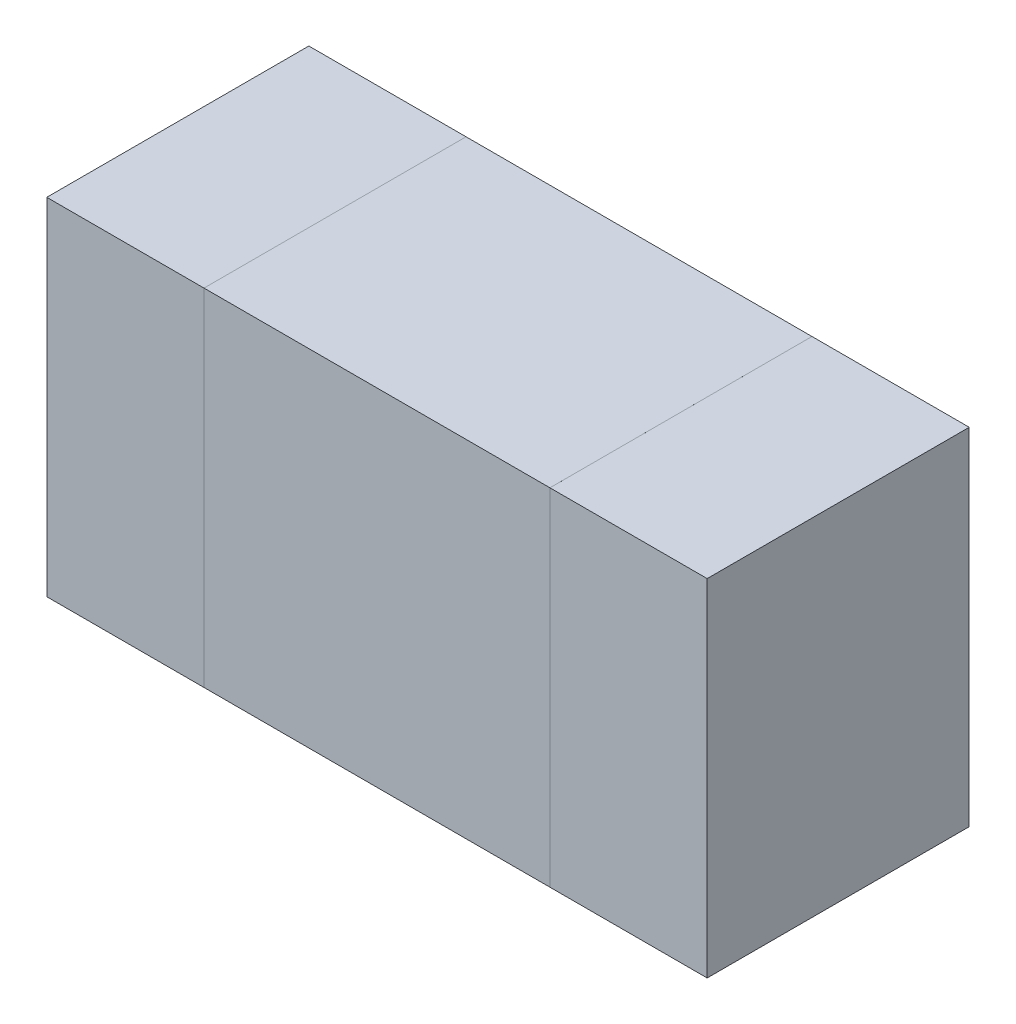
ISO-10303-21;
HEADER;
FILE_DESCRIPTION(('STEP AP214'),'2;1');
FILE_NAME('part.step','',(''),(''),'','','');
FILE_SCHEMA(('AUTOMOTIVE_DESIGN { 1 0 10303 214 1 1 1 1 }'));
ENDSEC;
DATA;
#1=APPLICATION_CONTEXT('core data for automotive mechanical design processes');
#2=APPLICATION_PROTOCOL_DEFINITION('international standard','automotive_design',2000,#1);
#3=PRODUCT_CONTEXT('',#1,'mechanical');
#4=PRODUCT('Part','Part','',(#3));
#5=PRODUCT_RELATED_PRODUCT_CATEGORY('part','',(#4));
#6=PRODUCT_DEFINITION_FORMATION('','',#4);
#7=PRODUCT_DEFINITION_CONTEXT('part definition',#1,'design');
#8=PRODUCT_DEFINITION('design','',#6,#7);
#9=PRODUCT_DEFINITION_SHAPE('','',#8);
#10=(LENGTH_UNIT() NAMED_UNIT(*) SI_UNIT(.MILLI.,.METRE.));
#11=(NAMED_UNIT(*) PLANE_ANGLE_UNIT() SI_UNIT($,.RADIAN.));
#12=(NAMED_UNIT(*) SI_UNIT($,.STERADIAN.) SOLID_ANGLE_UNIT());
#13=UNCERTAINTY_MEASURE_WITH_UNIT(LENGTH_MEASURE(1.E-05),#10,'distance_accuracy_value','');
#14=(GEOMETRIC_REPRESENTATION_CONTEXT(3) GLOBAL_UNCERTAINTY_ASSIGNED_CONTEXT((#13)) GLOBAL_UNIT_ASSIGNED_CONTEXT((#10,
#11,#12)) REPRESENTATION_CONTEXT('',''));
#15=CARTESIAN_POINT('',(0.,0.,0.));
#16=DIRECTION('',(0.,0.,1.));
#17=DIRECTION('',(1.,0.,0.));
#18=AXIS2_PLACEMENT_3D('',#15,#16,#17);
#19=CARTESIAN_POINT('',(9.38999031418,8.734999960195,0.2499995));
#20=DIRECTION('',(0.,0.,-1.));
#21=DIRECTION('',(0.,-1.,0.));
#22=AXIS2_PLACEMENT_3D('',#19,#20,#21);
#23=PLANE('',#22);
#24=DIRECTION('',(0.,1.,0.));
#25=VECTOR('',#24,1.);
#26=CARTESIAN_POINT('',(9.38999031418,8.734999960195,0.2499995));
#27=LINE('',#26,#25);
#28=CARTESIAN_POINT('',(9.38999031418,8.734999960195,0.2499995));
#29=VERTEX_POINT('',#28);
#30=CARTESIAN_POINT('',(9.38999031418,9.064996760195,0.2499995));
#31=VERTEX_POINT('',#30);
#32=EDGE_CURVE('P0_E93',#29,#31,#27,.T.);
#33=ORIENTED_EDGE('',*,*,#32,.T.);
#34=DIRECTION('',(-1.,0.,0.));
#35=VECTOR('',#34,1.);
#36=CARTESIAN_POINT('',(9.38999031418,9.064996760195,0.2499995));
#37=LINE('',#36,#35);
#38=CARTESIAN_POINT('',(9.05999605418,9.064996760195,0.2499995));
#39=VERTEX_POINT('',#38);
#40=EDGE_CURVE('P0_E72',#31,#39,#37,.T.);
#41=ORIENTED_EDGE('',*,*,#40,.T.);
#42=DIRECTION('',(0.,-1.,0.));
#43=VECTOR('',#42,1.);
#44=CARTESIAN_POINT('',(9.05999605418,9.064996760195,0.2499995));
#45=LINE('',#44,#43);
#46=CARTESIAN_POINT('',(9.05999605418,8.734999960195,0.2499995));
#47=VERTEX_POINT('',#46);
#48=EDGE_CURVE('P0_E77',#39,#47,#45,.T.);
#49=ORIENTED_EDGE('',*,*,#48,.T.);
#50=DIRECTION('',(1.,0.,0.));
#51=VECTOR('',#50,1.);
#52=CARTESIAN_POINT('',(9.05999605418,8.734999960195,0.2499995));
#53=LINE('',#52,#51);
#54=EDGE_CURVE('P0_E11',#47,#29,#53,.T.);
#55=ORIENTED_EDGE('',*,*,#54,.T.);
#56=EDGE_LOOP('',(#33,#41,#49,#55));
#57=FACE_BOUND('',#56,.T.);
#58=ADVANCED_FACE('P0_F17',(#57),#23,.F.);
#59=CARTESIAN_POINT('',(9.38999031418,8.734999960195,0.));
#60=DIRECTION('',(0.,0.,-1.));
#61=DIRECTION('',(0.,-1.,0.));
#62=AXIS2_PLACEMENT_3D('',#59,#60,#61);
#63=PLANE('',#62);
#64=DIRECTION('',(1.,0.,0.));
#65=VECTOR('',#64,1.);
#66=CARTESIAN_POINT('',(9.05999605418,8.734999960195,0.));
#67=LINE('',#66,#65);
#68=CARTESIAN_POINT('',(9.05999605418,8.734999960195,0.));
#69=VERTEX_POINT('',#68);
#70=CARTESIAN_POINT('',(9.38999031418,8.734999960195,0.));
#71=VERTEX_POINT('',#70);
#72=EDGE_CURVE('P0_E20',#69,#71,#67,.T.);
#73=ORIENTED_EDGE('',*,*,#72,.F.);
#74=DIRECTION('',(0.,-1.,0.));
#75=VECTOR('',#74,1.);
#76=CARTESIAN_POINT('',(9.05999605418,9.064996760195,0.));
#77=LINE('',#76,#75);
#78=CARTESIAN_POINT('',(9.05999605418,9.064996760195,0.));
#79=VERTEX_POINT('',#78);
#80=EDGE_CURVE('P0_E61',#79,#69,#77,.T.);
#81=ORIENTED_EDGE('',*,*,#80,.F.);
#82=DIRECTION('',(-1.,0.,0.));
#83=VECTOR('',#82,1.);
#84=CARTESIAN_POINT('',(9.38999031418,9.064996760195,0.));
#85=LINE('',#84,#83);
#86=CARTESIAN_POINT('',(9.38999031418,9.064996760195,0.));
#87=VERTEX_POINT('',#86);
#88=EDGE_CURVE('P0_E66',#87,#79,#85,.T.);
#89=ORIENTED_EDGE('',*,*,#88,.F.);
#90=DIRECTION('',(0.,1.,0.));
#91=VECTOR('',#90,1.);
#92=CARTESIAN_POINT('',(9.38999031418,8.734999960195,0.));
#93=LINE('',#92,#91);
#94=EDGE_CURVE('P0_E115',#71,#87,#93,.T.);
#95=ORIENTED_EDGE('',*,*,#94,.F.);
#96=EDGE_LOOP('',(#73,#81,#89,#95));
#97=FACE_BOUND('',#96,.T.);
#98=ADVANCED_FACE('P0_F63',(#97),#63,.T.);
#99=CARTESIAN_POINT('',(9.05999605418,8.734999960195,0.));
#100=DIRECTION('',(0.,1.,0.));
#101=DIRECTION('',(1.,0.,0.));
#102=AXIS2_PLACEMENT_3D('',#99,#100,#101);
#103=PLANE('',#102);
#104=ORIENTED_EDGE('',*,*,#72,.T.);
#105=DIRECTION('',(0.,0.,1.));
#106=VECTOR('',#105,1.);
#107=CARTESIAN_POINT('',(9.38999031418,8.734999960195,0.));
#108=LINE('',#107,#106);
#109=EDGE_CURVE('P0_E88',#71,#29,#108,.T.);
#110=ORIENTED_EDGE('',*,*,#109,.T.);
#111=ORIENTED_EDGE('',*,*,#54,.F.);
#112=DIRECTION('',(0.,0.,1.));
#113=VECTOR('',#112,1.);
#114=CARTESIAN_POINT('',(9.05999605418,8.734999960195,0.));
#115=LINE('',#114,#113);
#116=EDGE_CURVE('P0_E71',#69,#47,#115,.T.);
#117=ORIENTED_EDGE('',*,*,#116,.F.);
#118=EDGE_LOOP('',(#104,#110,#111,#117));
#119=FACE_BOUND('',#118,.T.);
#120=ADVANCED_FACE('P0_F109',(#119),#103,.F.);
#121=CARTESIAN_POINT('',(9.05999605418,9.064996760195,0.));
#122=DIRECTION('',(1.,0.,0.));
#123=DIRECTION('',(0.,1.,0.));
#124=AXIS2_PLACEMENT_3D('',#121,#122,#123);
#125=PLANE('',#124);
#126=ORIENTED_EDGE('',*,*,#80,.T.);
#127=ORIENTED_EDGE('',*,*,#116,.T.);
#128=ORIENTED_EDGE('',*,*,#48,.F.);
#129=DIRECTION('',(0.,0.,1.));
#130=VECTOR('',#129,1.);
#131=CARTESIAN_POINT('',(9.05999605418,9.064996760195,0.));
#132=LINE('',#131,#130);
#133=EDGE_CURVE('P0_E75',#79,#39,#132,.T.);
#134=ORIENTED_EDGE('',*,*,#133,.F.);
#135=EDGE_LOOP('',(#126,#127,#128,#134));
#136=FACE_BOUND('',#135,.T.);
#137=ADVANCED_FACE('P0_F76',(#136),#125,.F.);
#138=CARTESIAN_POINT('',(9.38999031418,9.064996760195,0.));
#139=DIRECTION('',(0.,-1.,0.));
#140=DIRECTION('',(0.,0.,-1.));
#141=AXIS2_PLACEMENT_3D('',#138,#139,#140);
#142=PLANE('',#141);
#143=ORIENTED_EDGE('',*,*,#88,.T.);
#144=ORIENTED_EDGE('',*,*,#133,.T.);
#145=ORIENTED_EDGE('',*,*,#40,.F.);
#146=DIRECTION('',(0.,0.,1.));
#147=VECTOR('',#146,1.);
#148=CARTESIAN_POINT('',(9.38999031418,9.064996760195,0.));
#149=LINE('',#148,#147);
#150=EDGE_CURVE('P0_E85',#87,#31,#149,.T.);
#151=ORIENTED_EDGE('',*,*,#150,.F.);
#152=EDGE_LOOP('',(#143,#144,#145,#151));
#153=FACE_BOUND('',#152,.T.);
#154=ADVANCED_FACE('P0_F83',(#153),#142,.F.);
#155=CARTESIAN_POINT('',(9.38999031418,8.734999960195,0.));
#156=DIRECTION('',(-1.,0.,0.));
#157=DIRECTION('',(0.,0.,1.));
#158=AXIS2_PLACEMENT_3D('',#155,#156,#157);
#159=PLANE('',#158);
#160=ORIENTED_EDGE('',*,*,#94,.T.);
#161=ORIENTED_EDGE('',*,*,#150,.T.);
#162=ORIENTED_EDGE('',*,*,#32,.F.);
#163=ORIENTED_EDGE('',*,*,#109,.F.);
#164=EDGE_LOOP('',(#160,#161,#162,#163));
#165=FACE_BOUND('',#164,.T.);
#166=ADVANCED_FACE('P0_F114',(#165),#159,.F.);
#167=CLOSED_SHELL('',(#58,#98,#120,#137,#154,#166));
#168=MANIFOLD_SOLID_BREP('P0_B1',#167);
#169=CARTESIAN_POINT('',(9.540001067344,8.734999960195,0.2499995));
#170=DIRECTION('',(0.,0.,-1.));
#171=DIRECTION('',(0.,-1.,0.));
#172=AXIS2_PLACEMENT_3D('',#169,#170,#171);
#173=PLANE('',#172);
#174=DIRECTION('',(0.,1.,0.));
#175=VECTOR('',#174,1.);
#176=CARTESIAN_POINT('',(9.540001067344,8.734999960195,0.2499995));
#177=LINE('',#176,#175);
#178=CARTESIAN_POINT('',(9.540001067344,8.734999960195,0.2499995));
#179=VERTEX_POINT('',#178);
#180=CARTESIAN_POINT('',(9.540001067344,9.064996760195,0.2499995));
#181=VERTEX_POINT('',#180);
#182=EDGE_CURVE('P1_E96',#179,#181,#177,.T.);
#183=ORIENTED_EDGE('',*,*,#182,.T.);
#184=DIRECTION('',(-1.,0.,0.));
#185=VECTOR('',#184,1.);
#186=CARTESIAN_POINT('',(9.540001067344,9.064996760195,0.2499995));
#187=LINE('',#186,#185);
#188=CARTESIAN_POINT('',(9.389993747344,9.064996760195,0.2499995));
#189=VERTEX_POINT('',#188);
#190=EDGE_CURVE('P1_E75',#181,#189,#187,.T.);
#191=ORIENTED_EDGE('',*,*,#190,.T.);
#192=DIRECTION('',(0.,-1.,0.));
#193=VECTOR('',#192,1.);
#194=CARTESIAN_POINT('',(9.389993747344,9.064996760195,0.2499995));
#195=LINE('',#194,#193);
#196=CARTESIAN_POINT('',(9.389993747344,8.734999960195,0.2499995));
#197=VERTEX_POINT('',#196);
#198=EDGE_CURVE('P1_E80',#189,#197,#195,.T.);
#199=ORIENTED_EDGE('',*,*,#198,.T.);
#200=DIRECTION('',(1.,0.,0.));
#201=VECTOR('',#200,1.);
#202=CARTESIAN_POINT('',(9.389993747344,8.734999960195,0.2499995));
#203=LINE('',#202,#201);
#204=EDGE_CURVE('P1_E11',#197,#179,#203,.T.);
#205=ORIENTED_EDGE('',*,*,#204,.T.);
#206=EDGE_LOOP('',(#183,#191,#199,#205));
#207=FACE_BOUND('',#206,.T.);
#208=ADVANCED_FACE('P1_F17',(#207),#173,.F.);
#209=CARTESIAN_POINT('',(9.540001067344,8.734999960195,0.));
#210=DIRECTION('',(0.,0.,-1.));
#211=DIRECTION('',(0.,-1.,0.));
#212=AXIS2_PLACEMENT_3D('',#209,#210,#211);
#213=PLANE('',#212);
#214=DIRECTION('',(1.,0.,0.));
#215=VECTOR('',#214,1.);
#216=CARTESIAN_POINT('',(9.389993747344,8.734999960195,0.));
#217=LINE('',#216,#215);
#218=CARTESIAN_POINT('',(9.389993747344,8.734999960195,0.));
#219=VERTEX_POINT('',#218);
#220=CARTESIAN_POINT('',(9.540001067344,8.734999960195,0.));
#221=VERTEX_POINT('',#220);
#222=EDGE_CURVE('P1_E26',#219,#221,#217,.T.);
#223=ORIENTED_EDGE('',*,*,#222,.F.);
#224=DIRECTION('',(0.,-1.,0.));
#225=VECTOR('',#224,1.);
#226=CARTESIAN_POINT('',(9.389993747344,9.064996760195,0.));
#227=LINE('',#226,#225);
#228=CARTESIAN_POINT('',(9.389993747344,9.064996760195,0.));
#229=VERTEX_POINT('',#228);
#230=EDGE_CURVE('P1_E64',#229,#219,#227,.T.);
#231=ORIENTED_EDGE('',*,*,#230,.F.);
#232=DIRECTION('',(-1.,0.,0.));
#233=VECTOR('',#232,1.);
#234=CARTESIAN_POINT('',(9.540001067344,9.064996760195,0.));
#235=LINE('',#234,#233);
#236=CARTESIAN_POINT('',(9.540001067344,9.064996760195,0.));
#237=VERTEX_POINT('',#236);
#238=EDGE_CURVE('P1_E69',#237,#229,#235,.T.);
#239=ORIENTED_EDGE('',*,*,#238,.F.);
#240=DIRECTION('',(0.,1.,0.));
#241=VECTOR('',#240,1.);
#242=CARTESIAN_POINT('',(9.540001067344,8.734999960195,0.));
#243=LINE('',#242,#241);
#244=EDGE_CURVE('P1_E100',#221,#237,#243,.T.);
#245=ORIENTED_EDGE('',*,*,#244,.F.);
#246=EDGE_LOOP('',(#223,#231,#239,#245));
#247=FACE_BOUND('',#246,.T.);
#248=ADVANCED_FACE('P1_F66',(#247),#213,.T.);
#249=CARTESIAN_POINT('',(9.389993747344,8.734999960195,0.));
#250=DIRECTION('',(0.,1.,0.));
#251=DIRECTION('',(1.,0.,0.));
#252=AXIS2_PLACEMENT_3D('',#249,#250,#251);
#253=PLANE('',#252);
#254=ORIENTED_EDGE('',*,*,#222,.T.);
#255=DIRECTION('',(0.,0.,1.));
#256=VECTOR('',#255,1.);
#257=CARTESIAN_POINT('',(9.540001067344,8.734999960195,0.));
#258=LINE('',#257,#256);
#259=EDGE_CURVE('P1_E90',#221,#179,#258,.T.);
#260=ORIENTED_EDGE('',*,*,#259,.T.);
#261=ORIENTED_EDGE('',*,*,#204,.F.);
#262=DIRECTION('',(0.,0.,1.));
#263=VECTOR('',#262,1.);
#264=CARTESIAN_POINT('',(9.389993747344,8.734999960195,0.));
#265=LINE('',#264,#263);
#266=EDGE_CURVE('P1_E74',#219,#197,#265,.T.);
#267=ORIENTED_EDGE('',*,*,#266,.F.);
#268=EDGE_LOOP('',(#254,#260,#261,#267));
#269=FACE_BOUND('',#268,.T.);
#270=ADVANCED_FACE('P1_F113',(#269),#253,.F.);
#271=CARTESIAN_POINT('',(9.389993747344,9.064996760195,0.));
#272=DIRECTION('',(1.,0.,0.));
#273=DIRECTION('',(0.,1.,0.));
#274=AXIS2_PLACEMENT_3D('',#271,#272,#273);
#275=PLANE('',#274);
#276=ORIENTED_EDGE('',*,*,#230,.T.);
#277=ORIENTED_EDGE('',*,*,#266,.T.);
#278=ORIENTED_EDGE('',*,*,#198,.F.);
#279=DIRECTION('',(0.,0.,1.));
#280=VECTOR('',#279,1.);
#281=CARTESIAN_POINT('',(9.389993747344,9.064996760195,0.));
#282=LINE('',#281,#280);
#283=EDGE_CURVE('P1_E78',#229,#189,#282,.T.);
#284=ORIENTED_EDGE('',*,*,#283,.F.);
#285=EDGE_LOOP('',(#276,#277,#278,#284));
#286=FACE_BOUND('',#285,.T.);
#287=ADVANCED_FACE('P1_F79',(#286),#275,.F.);
#288=CARTESIAN_POINT('',(9.540001067344,9.064996760195,0.));
#289=DIRECTION('',(0.,-1.,0.));
#290=DIRECTION('',(0.,0.,-1.));
#291=AXIS2_PLACEMENT_3D('',#288,#289,#290);
#292=PLANE('',#291);
#293=ORIENTED_EDGE('',*,*,#238,.T.);
#294=ORIENTED_EDGE('',*,*,#283,.T.);
#295=ORIENTED_EDGE('',*,*,#190,.F.);
#296=DIRECTION('',(0.,0.,1.));
#297=VECTOR('',#296,1.);
#298=CARTESIAN_POINT('',(9.540001067344,9.064996760195,0.));
#299=LINE('',#298,#297);
#300=EDGE_CURVE('P1_E87',#237,#181,#299,.T.);
#301=ORIENTED_EDGE('',*,*,#300,.F.);
#302=EDGE_LOOP('',(#293,#294,#295,#301));
#303=FACE_BOUND('',#302,.T.);
#304=ADVANCED_FACE('P1_F85',(#303),#292,.F.);
#305=CARTESIAN_POINT('',(9.540001067344,8.734999960195,0.));
#306=DIRECTION('',(-1.,0.,0.));
#307=DIRECTION('',(0.,0.,1.));
#308=AXIS2_PLACEMENT_3D('',#305,#306,#307);
#309=PLANE('',#308);
#310=ORIENTED_EDGE('',*,*,#244,.T.);
#311=ORIENTED_EDGE('',*,*,#300,.T.);
#312=ORIENTED_EDGE('',*,*,#182,.F.);
#313=ORIENTED_EDGE('',*,*,#259,.F.);
#314=EDGE_LOOP('',(#310,#311,#312,#313));
#315=FACE_BOUND('',#314,.T.);
#316=ADVANCED_FACE('P1_F116',(#315),#309,.F.);
#317=CLOSED_SHELL('',(#208,#248,#270,#287,#304,#316));
#318=MANIFOLD_SOLID_BREP('P1_B1',#317);
#319=CARTESIAN_POINT('',(9.060005339805,8.734999960195,0.2499995));
#320=DIRECTION('',(0.,0.,-1.));
#321=DIRECTION('',(0.,-1.,0.));
#322=AXIS2_PLACEMENT_3D('',#319,#320,#321);
#323=PLANE('',#322);
#324=DIRECTION('',(0.,1.,0.));
#325=VECTOR('',#324,1.);
#326=CARTESIAN_POINT('',(9.060005339805,8.734999960195,0.2499995));
#327=LINE('',#326,#325);
#328=CARTESIAN_POINT('',(9.060005339805,8.734999960195,0.2499995));
#329=VERTEX_POINT('',#328);
#330=CARTESIAN_POINT('',(9.060005339805,9.064996760195,0.2499995));
#331=VERTEX_POINT('',#330);
#332=EDGE_CURVE('P2_E82',#329,#331,#327,.T.);
#333=ORIENTED_EDGE('',*,*,#332,.T.);
#334=DIRECTION('',(-1.,0.,0.));
#335=VECTOR('',#334,1.);
#336=CARTESIAN_POINT('',(9.060005339805,9.064996760195,0.2499995));
#337=LINE('',#336,#335);
#338=CARTESIAN_POINT('',(8.909998019805,9.064996760195,0.2499995));
#339=VERTEX_POINT('',#338);
#340=EDGE_CURVE('P2_E102',#331,#339,#337,.T.);
#341=ORIENTED_EDGE('',*,*,#340,.T.);
#342=DIRECTION('',(0.,-1.,0.));
#343=VECTOR('',#342,1.);
#344=CARTESIAN_POINT('',(8.909998019805,9.064996760195,0.2499995));
#345=LINE('',#344,#343);
#346=CARTESIAN_POINT('',(8.909998019805,8.734999960195,0.2499995));
#347=VERTEX_POINT('',#346);
#348=EDGE_CURVE('P2_E74',#339,#347,#345,.T.);
#349=ORIENTED_EDGE('',*,*,#348,.T.);
#350=DIRECTION('',(1.,0.,0.));
#351=VECTOR('',#350,1.);
#352=CARTESIAN_POINT('',(8.909998019805,8.734999960195,0.2499995));
#353=LINE('',#352,#351);
#354=EDGE_CURVE('P2_E11',#347,#329,#353,.T.);
#355=ORIENTED_EDGE('',*,*,#354,.T.);
#356=EDGE_LOOP('',(#333,#341,#349,#355));
#357=FACE_BOUND('',#356,.T.);
#358=ADVANCED_FACE('P2_F17',(#357),#323,.F.);
#359=CARTESIAN_POINT('',(9.060005339805,8.734999960195,0.));
#360=DIRECTION('',(0.,0.,-1.));
#361=DIRECTION('',(0.,-1.,0.));
#362=AXIS2_PLACEMENT_3D('',#359,#360,#361);
#363=PLANE('',#362);
#364=DIRECTION('',(1.,0.,0.));
#365=VECTOR('',#364,1.);
#366=CARTESIAN_POINT('',(8.909998019805,8.734999960195,0.));
#367=LINE('',#366,#365);
#368=CARTESIAN_POINT('',(8.909998019805,8.734999960195,0.));
#369=VERTEX_POINT('',#368);
#370=CARTESIAN_POINT('',(9.060005339805,8.734999960195,0.));
#371=VERTEX_POINT('',#370);
#372=EDGE_CURVE('P2_E25',#369,#371,#367,.T.);
#373=ORIENTED_EDGE('',*,*,#372,.F.);
#374=DIRECTION('',(0.,-1.,0.));
#375=VECTOR('',#374,1.);
#376=CARTESIAN_POINT('',(8.909998019805,9.064996760195,0.));
#377=LINE('',#376,#375);
#378=CARTESIAN_POINT('',(8.909998019805,9.064996760195,0.));
#379=VERTEX_POINT('',#378);
#380=EDGE_CURVE('P2_E108',#379,#369,#377,.T.);
#381=ORIENTED_EDGE('',*,*,#380,.F.);
#382=DIRECTION('',(-1.,0.,0.));
#383=VECTOR('',#382,1.);
#384=CARTESIAN_POINT('',(9.060005339805,9.064996760195,0.));
#385=LINE('',#384,#383);
#386=CARTESIAN_POINT('',(9.060005339805,9.064996760195,0.));
#387=VERTEX_POINT('',#386);
#388=EDGE_CURVE('P2_E84',#387,#379,#385,.T.);
#389=ORIENTED_EDGE('',*,*,#388,.F.);
#390=DIRECTION('',(0.,1.,0.));
#391=VECTOR('',#390,1.);
#392=CARTESIAN_POINT('',(9.060005339805,8.734999960195,0.));
#393=LINE('',#392,#391);
#394=EDGE_CURVE('P2_E80',#371,#387,#393,.T.);
#395=ORIENTED_EDGE('',*,*,#394,.F.);
#396=EDGE_LOOP('',(#373,#381,#389,#395));
#397=FACE_BOUND('',#396,.T.);
#398=ADVANCED_FACE('P2_F86',(#397),#363,.T.);
#399=CARTESIAN_POINT('',(8.909998019805,8.734999960195,0.));
#400=DIRECTION('',(0.,1.,0.));
#401=DIRECTION('',(1.,0.,0.));
#402=AXIS2_PLACEMENT_3D('',#399,#400,#401);
#403=PLANE('',#402);
#404=ORIENTED_EDGE('',*,*,#372,.T.);
#405=DIRECTION('',(0.,0.,1.));
#406=VECTOR('',#405,1.);
#407=CARTESIAN_POINT('',(9.060005339805,8.734999960195,0.));
#408=LINE('',#407,#406);
#409=EDGE_CURVE('P2_E68',#371,#329,#408,.T.);
#410=ORIENTED_EDGE('',*,*,#409,.T.);
#411=ORIENTED_EDGE('',*,*,#354,.F.);
#412=DIRECTION('',(0.,0.,1.));
#413=VECTOR('',#412,1.);
#414=CARTESIAN_POINT('',(8.909998019805,8.734999960195,0.));
#415=LINE('',#414,#413);
#416=EDGE_CURVE('P2_E71',#369,#347,#415,.T.);
#417=ORIENTED_EDGE('',*,*,#416,.F.);
#418=EDGE_LOOP('',(#404,#410,#411,#417));
#419=FACE_BOUND('',#418,.T.);
#420=ADVANCED_FACE('P2_F67',(#419),#403,.F.);
#421=CARTESIAN_POINT('',(8.909998019805,9.064996760195,0.));
#422=DIRECTION('',(1.,0.,0.));
#423=DIRECTION('',(0.,1.,0.));
#424=AXIS2_PLACEMENT_3D('',#421,#422,#423);
#425=PLANE('',#424);
#426=ORIENTED_EDGE('',*,*,#380,.T.);
#427=ORIENTED_EDGE('',*,*,#416,.T.);
#428=ORIENTED_EDGE('',*,*,#348,.F.);
#429=DIRECTION('',(0.,0.,1.));
#430=VECTOR('',#429,1.);
#431=CARTESIAN_POINT('',(8.909998019805,9.064996760195,0.));
#432=LINE('',#431,#430);
#433=EDGE_CURVE('P2_E98',#379,#339,#432,.T.);
#434=ORIENTED_EDGE('',*,*,#433,.F.);
#435=EDGE_LOOP('',(#426,#427,#428,#434));
#436=FACE_BOUND('',#435,.T.);
#437=ADVANCED_FACE('P2_F117',(#436),#425,.F.);
#438=CARTESIAN_POINT('',(9.060005339805,9.064996760195,0.));
#439=DIRECTION('',(0.,-1.,0.));
#440=DIRECTION('',(0.,0.,-1.));
#441=AXIS2_PLACEMENT_3D('',#438,#439,#440);
#442=PLANE('',#441);
#443=ORIENTED_EDGE('',*,*,#388,.T.);
#444=ORIENTED_EDGE('',*,*,#433,.T.);
#445=ORIENTED_EDGE('',*,*,#340,.F.);
#446=DIRECTION('',(0.,0.,1.));
#447=VECTOR('',#446,1.);
#448=CARTESIAN_POINT('',(9.060005339805,9.064996760195,0.));
#449=LINE('',#448,#447);
#450=EDGE_CURVE('P2_E90',#387,#331,#449,.T.);
#451=ORIENTED_EDGE('',*,*,#450,.F.);
#452=EDGE_LOOP('',(#443,#444,#445,#451));
#453=FACE_BOUND('',#452,.T.);
#454=ADVANCED_FACE('P2_F119',(#453),#442,.F.);
#455=CARTESIAN_POINT('',(9.060005339805,8.734999960195,0.));
#456=DIRECTION('',(-1.,0.,0.));
#457=DIRECTION('',(0.,0.,1.));
#458=AXIS2_PLACEMENT_3D('',#455,#456,#457);
#459=PLANE('',#458);
#460=ORIENTED_EDGE('',*,*,#394,.T.);
#461=ORIENTED_EDGE('',*,*,#450,.T.);
#462=ORIENTED_EDGE('',*,*,#332,.F.);
#463=ORIENTED_EDGE('',*,*,#409,.F.);
#464=EDGE_LOOP('',(#460,#461,#462,#463));
#465=FACE_BOUND('',#464,.T.);
#466=ADVANCED_FACE('P2_F78',(#465),#459,.F.);
#467=CLOSED_SHELL('',(#358,#398,#420,#437,#454,#466));
#468=MANIFOLD_SOLID_BREP('P2_B1',#467);
#469=ADVANCED_BREP_SHAPE_REPRESENTATION('',(#18,#168,#318,#468),#14);
#470=SHAPE_DEFINITION_REPRESENTATION(#9,#469);
ENDSEC;
END-ISO-10303-21;
